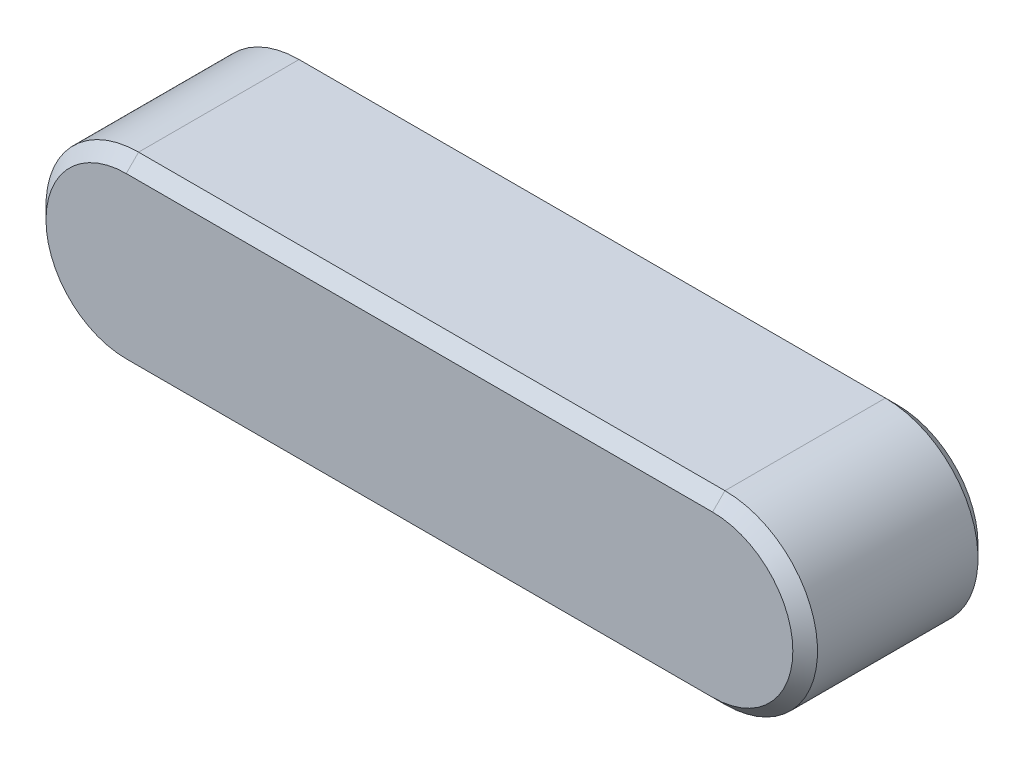
ISO-10303-21;
HEADER;
FILE_DESCRIPTION(('STEP AP214'),'2;1');
FILE_NAME('part.step','',(''),(''),'','','');
FILE_SCHEMA(('AUTOMOTIVE_DESIGN { 1 0 10303 214 1 1 1 1 }'));
ENDSEC;
DATA;
#1=APPLICATION_CONTEXT('core data for automotive mechanical design processes');
#2=APPLICATION_PROTOCOL_DEFINITION('international standard','automotive_design',2000,#1);
#3=PRODUCT_CONTEXT('',#1,'mechanical');
#4=PRODUCT('Part','Part','',(#3));
#5=PRODUCT_RELATED_PRODUCT_CATEGORY('part','',(#4));
#6=PRODUCT_DEFINITION_FORMATION('','',#4);
#7=PRODUCT_DEFINITION_CONTEXT('part definition',#1,'design');
#8=PRODUCT_DEFINITION('design','',#6,#7);
#9=PRODUCT_DEFINITION_SHAPE('','',#8);
#10=(LENGTH_UNIT() NAMED_UNIT(*) SI_UNIT(.MILLI.,.METRE.));
#11=(NAMED_UNIT(*) PLANE_ANGLE_UNIT() SI_UNIT($,.RADIAN.));
#12=(NAMED_UNIT(*) SI_UNIT($,.STERADIAN.) SOLID_ANGLE_UNIT());
#13=UNCERTAINTY_MEASURE_WITH_UNIT(LENGTH_MEASURE(1.E-05),#10,'distance_accuracy_value','');
#14=(GEOMETRIC_REPRESENTATION_CONTEXT(3) GLOBAL_UNCERTAINTY_ASSIGNED_CONTEXT((#13)) GLOBAL_UNIT_ASSIGNED_CONTEXT((#10,
#11,#12)) REPRESENTATION_CONTEXT('',''));
#15=CARTESIAN_POINT('',(0.,0.,0.));
#16=DIRECTION('',(0.,0.,1.));
#17=DIRECTION('',(1.,0.,0.));
#18=AXIS2_PLACEMENT_3D('',#15,#16,#17);
#19=CARTESIAN_POINT('',(-19.,0.,3.));
#20=DIRECTION('',(0.,0.,-1.));
#21=DIRECTION('',(-1.,0.,0.));
#22=AXIS2_PLACEMENT_3D('',#19,#20,#21);
#23=CYLINDRICAL_SURFACE('',#22,3.);
#24=DIRECTION('',(0.,0.,-1.));
#25=VECTOR('',#24,1.);
#26=CARTESIAN_POINT('',(-19.,-3.,3.));
#27=LINE('',#26,#25);
#28=CARTESIAN_POINT('',(-19.,-3.,2.6));
#29=VERTEX_POINT('',#28);
#30=CARTESIAN_POINT('',(-19.,-3.,-2.6));
#31=VERTEX_POINT('',#30);
#32=EDGE_CURVE('E122',#29,#31,#27,.T.);
#33=ORIENTED_EDGE('',*,*,#32,.F.);
#34=CARTESIAN_POINT('',(-19.,0.,2.6));
#35=DIRECTION('',(0.,0.,-1.));
#36=DIRECTION('',(-1.,0.,0.));
#37=AXIS2_PLACEMENT_3D('',#34,#35,#36);
#38=CIRCLE('',#37,3.);
#39=CARTESIAN_POINT('',(-19.,3.,2.6));
#40=VERTEX_POINT('',#39);
#41=EDGE_CURVE('E56',#29,#40,#38,.T.);
#42=ORIENTED_EDGE('',*,*,#41,.T.);
#43=DIRECTION('',(0.,0.,-1.));
#44=VECTOR('',#43,1.);
#45=CARTESIAN_POINT('',(-19.,3.,3.));
#46=LINE('',#45,#44);
#47=CARTESIAN_POINT('',(-19.,3.,-2.6));
#48=VERTEX_POINT('',#47);
#49=EDGE_CURVE('E160',#40,#48,#46,.T.);
#50=ORIENTED_EDGE('',*,*,#49,.T.);
#51=CARTESIAN_POINT('',(-19.,0.,-2.6));
#52=DIRECTION('',(0.,0.,-1.));
#53=DIRECTION('',(-1.,0.,0.));
#54=AXIS2_PLACEMENT_3D('',#51,#52,#53);
#55=CIRCLE('',#54,3.);
#56=EDGE_CURVE('E110',#48,#31,#55,.F.);
#57=ORIENTED_EDGE('',*,*,#56,.T.);
#58=EDGE_LOOP('',(#33,#42,#50,#57));
#59=FACE_BOUND('',#58,.T.);
#60=ADVANCED_FACE('F33',(#59),#23,.T.);
#61=CARTESIAN_POINT('',(0.,-3.,3.));
#62=DIRECTION('',(0.,1.,0.));
#63=DIRECTION('',(-1.,0.,0.));
#64=AXIS2_PLACEMENT_3D('',#61,#62,#63);
#65=PLANE('',#64);
#66=ORIENTED_EDGE('',*,*,#32,.T.);
#67=DIRECTION('',(1.,0.,0.));
#68=VECTOR('',#67,1.);
#69=CARTESIAN_POINT('',(0.,-3.,-2.6));
#70=LINE('',#69,#68);
#71=CARTESIAN_POINT('',(0.,-3.,-2.6));
#72=VERTEX_POINT('',#71);
#73=EDGE_CURVE('E121',#31,#72,#70,.T.);
#74=ORIENTED_EDGE('',*,*,#73,.T.);
#75=DIRECTION('',(0.,0.,-1.));
#76=VECTOR('',#75,1.);
#77=CARTESIAN_POINT('',(0.,-3.,3.));
#78=LINE('',#77,#76);
#79=CARTESIAN_POINT('',(0.,-3.,2.6));
#80=VERTEX_POINT('',#79);
#81=EDGE_CURVE('E104',#80,#72,#78,.T.);
#82=ORIENTED_EDGE('',*,*,#81,.F.);
#83=DIRECTION('',(-1.,0.,0.));
#84=VECTOR('',#83,1.);
#85=CARTESIAN_POINT('',(0.,-3.,2.6));
#86=LINE('',#85,#84);
#87=EDGE_CURVE('E119',#80,#29,#86,.T.);
#88=ORIENTED_EDGE('',*,*,#87,.T.);
#89=EDGE_LOOP('',(#66,#74,#82,#88));
#90=FACE_BOUND('',#89,.T.);
#91=ADVANCED_FACE('F118',(#90),#65,.F.);
#92=CARTESIAN_POINT('',(0.,0.,3.));
#93=DIRECTION('',(0.,0.,-1.));
#94=DIRECTION('',(-1.,0.,0.));
#95=AXIS2_PLACEMENT_3D('',#92,#93,#94);
#96=CYLINDRICAL_SURFACE('',#95,3.);
#97=DIRECTION('',(0.,0.,-1.));
#98=VECTOR('',#97,1.);
#99=CARTESIAN_POINT('',(0.,3.,3.));
#100=LINE('',#99,#98);
#101=CARTESIAN_POINT('',(0.,3.,2.6));
#102=VERTEX_POINT('',#101);
#103=CARTESIAN_POINT('',(0.,3.,-2.6));
#104=VERTEX_POINT('',#103);
#105=EDGE_CURVE('E105',#102,#104,#100,.T.);
#106=ORIENTED_EDGE('',*,*,#105,.F.);
#107=CARTESIAN_POINT('',(0.,0.,2.6));
#108=DIRECTION('',(0.,0.,-1.));
#109=DIRECTION('',(-1.,0.,0.));
#110=AXIS2_PLACEMENT_3D('',#107,#108,#109);
#111=CIRCLE('',#110,3.);
#112=EDGE_CURVE('E101',#102,#80,#111,.T.);
#113=ORIENTED_EDGE('',*,*,#112,.T.);
#114=ORIENTED_EDGE('',*,*,#81,.T.);
#115=CARTESIAN_POINT('',(0.,0.,-2.6));
#116=DIRECTION('',(0.,0.,-1.));
#117=DIRECTION('',(-1.,0.,0.));
#118=AXIS2_PLACEMENT_3D('',#115,#116,#117);
#119=CIRCLE('',#118,3.);
#120=EDGE_CURVE('E111',#72,#104,#119,.F.);
#121=ORIENTED_EDGE('',*,*,#120,.T.);
#122=EDGE_LOOP('',(#106,#113,#114,#121));
#123=FACE_BOUND('',#122,.T.);
#124=ADVANCED_FACE('F103',(#123),#96,.T.);
#125=CARTESIAN_POINT('',(-19.,3.,3.));
#126=DIRECTION('',(0.,-1.,0.));
#127=DIRECTION('',(0.,0.,-1.));
#128=AXIS2_PLACEMENT_3D('',#125,#126,#127);
#129=PLANE('',#128);
#130=ORIENTED_EDGE('',*,*,#49,.F.);
#131=DIRECTION('',(1.,0.,0.));
#132=VECTOR('',#131,1.);
#133=CARTESIAN_POINT('',(-19.,3.,2.6));
#134=LINE('',#133,#132);
#135=EDGE_CURVE('E11',#40,#102,#134,.T.);
#136=ORIENTED_EDGE('',*,*,#135,.T.);
#137=ORIENTED_EDGE('',*,*,#105,.T.);
#138=DIRECTION('',(-1.,0.,0.));
#139=VECTOR('',#138,1.);
#140=CARTESIAN_POINT('',(-19.,3.,-2.6));
#141=LINE('',#140,#139);
#142=EDGE_CURVE('E42',#104,#48,#141,.T.);
#143=ORIENTED_EDGE('',*,*,#142,.T.);
#144=EDGE_LOOP('',(#130,#136,#137,#143));
#145=FACE_BOUND('',#144,.T.);
#146=ADVANCED_FACE('F210',(#145),#129,.F.);
#147=CARTESIAN_POINT('',(-19.,0.,3.));
#148=DIRECTION('',(0.,0.,-1.));
#149=DIRECTION('',(-1.,0.,0.));
#150=AXIS2_PLACEMENT_3D('',#147,#148,#149);
#151=PLANE('',#150);
#152=CARTESIAN_POINT('',(-19.,0.,3.));
#153=DIRECTION('',(0.,0.,-1.));
#154=DIRECTION('',(-1.,0.,0.));
#155=AXIS2_PLACEMENT_3D('',#152,#153,#154);
#156=CIRCLE('',#155,2.6);
#157=CARTESIAN_POINT('',(-19.,2.6,3.));
#158=VERTEX_POINT('',#157);
#159=CARTESIAN_POINT('',(-19.,-2.6,3.));
#160=VERTEX_POINT('',#159);
#161=EDGE_CURVE('E181',#158,#160,#156,.F.);
#162=ORIENTED_EDGE('',*,*,#161,.T.);
#163=DIRECTION('',(1.,0.,0.));
#164=VECTOR('',#163,1.);
#165=CARTESIAN_POINT('',(-19.,-2.6,3.));
#166=LINE('',#165,#164);
#167=CARTESIAN_POINT('',(0.,-2.6,3.));
#168=VERTEX_POINT('',#167);
#169=EDGE_CURVE('E184',#160,#168,#166,.T.);
#170=ORIENTED_EDGE('',*,*,#169,.T.);
#171=CARTESIAN_POINT('',(0.,0.,3.));
#172=DIRECTION('',(0.,0.,-1.));
#173=DIRECTION('',(-1.,0.,0.));
#174=AXIS2_PLACEMENT_3D('',#171,#172,#173);
#175=CIRCLE('',#174,2.6);
#176=CARTESIAN_POINT('',(0.,2.6,3.));
#177=VERTEX_POINT('',#176);
#178=EDGE_CURVE('E133',#168,#177,#175,.F.);
#179=ORIENTED_EDGE('',*,*,#178,.T.);
#180=DIRECTION('',(-1.,0.,0.));
#181=VECTOR('',#180,1.);
#182=CARTESIAN_POINT('',(-19.,2.6,3.));
#183=LINE('',#182,#181);
#184=EDGE_CURVE('E179',#177,#158,#183,.T.);
#185=ORIENTED_EDGE('',*,*,#184,.T.);
#186=EDGE_LOOP('',(#162,#170,#179,#185));
#187=FACE_BOUND('',#186,.T.);
#188=ADVANCED_FACE('F213',(#187),#151,.F.);
#189=CARTESIAN_POINT('',(-19.,0.,-3.));
#190=DIRECTION('',(0.,0.,-1.));
#191=DIRECTION('',(-1.,0.,0.));
#192=AXIS2_PLACEMENT_3D('',#189,#190,#191);
#193=PLANE('',#192);
#194=CARTESIAN_POINT('',(0.,0.,-3.));
#195=DIRECTION('',(0.,0.,-1.));
#196=DIRECTION('',(-1.,0.,0.));
#197=AXIS2_PLACEMENT_3D('',#194,#195,#196);
#198=CIRCLE('',#197,2.6);
#199=CARTESIAN_POINT('',(0.,2.6,-3.));
#200=VERTEX_POINT('',#199);
#201=CARTESIAN_POINT('',(0.,-2.6,-3.));
#202=VERTEX_POINT('',#201);
#203=EDGE_CURVE('E174',#200,#202,#198,.T.);
#204=ORIENTED_EDGE('',*,*,#203,.T.);
#205=DIRECTION('',(-1.,0.,0.));
#206=VECTOR('',#205,1.);
#207=CARTESIAN_POINT('',(-19.,-2.6,-3.));
#208=LINE('',#207,#206);
#209=CARTESIAN_POINT('',(-19.,-2.6,-3.));
#210=VERTEX_POINT('',#209);
#211=EDGE_CURVE('E176',#202,#210,#208,.T.);
#212=ORIENTED_EDGE('',*,*,#211,.T.);
#213=CARTESIAN_POINT('',(-19.,0.,-3.));
#214=DIRECTION('',(0.,0.,-1.));
#215=DIRECTION('',(-1.,0.,0.));
#216=AXIS2_PLACEMENT_3D('',#213,#214,#215);
#217=CIRCLE('',#216,2.6);
#218=CARTESIAN_POINT('',(-19.,2.6,-3.));
#219=VERTEX_POINT('',#218);
#220=EDGE_CURVE('E172',#210,#219,#217,.T.);
#221=ORIENTED_EDGE('',*,*,#220,.T.);
#222=DIRECTION('',(1.,0.,0.));
#223=VECTOR('',#222,1.);
#224=CARTESIAN_POINT('',(0.,2.6,-3.));
#225=LINE('',#224,#223);
#226=EDGE_CURVE('E170',#219,#200,#225,.T.);
#227=ORIENTED_EDGE('',*,*,#226,.T.);
#228=EDGE_LOOP('',(#204,#212,#221,#227));
#229=FACE_BOUND('',#228,.T.);
#230=ADVANCED_FACE('F214',(#229),#193,.T.);
#231=CARTESIAN_POINT('',(-19.,3.,-2.6));
#232=DIRECTION('',(0.,0.707106781186547,-0.707106781186547));
#233=DIRECTION('',(0.,0.707106781186548,0.707106781186548));
#234=AXIS2_PLACEMENT_3D('',#231,#232,#233);
#235=PLANE('',#234);
#236=DIRECTION('',(0.,0.707106781186547,0.707106781186547));
#237=VECTOR('',#236,1.);
#238=CARTESIAN_POINT('',(0.,2.6,-3.));
#239=LINE('',#238,#237);
#240=EDGE_CURVE('E152',#200,#104,#239,.T.);
#241=ORIENTED_EDGE('',*,*,#240,.F.);
#242=ORIENTED_EDGE('',*,*,#226,.F.);
#243=DIRECTION('',(0.,-0.707106781186547,-0.707106781186547));
#244=VECTOR('',#243,1.);
#245=CARTESIAN_POINT('',(-19.,3.,-2.6));
#246=LINE('',#245,#244);
#247=EDGE_CURVE('E139',#48,#219,#246,.T.);
#248=ORIENTED_EDGE('',*,*,#247,.F.);
#249=ORIENTED_EDGE('',*,*,#142,.F.);
#250=EDGE_LOOP('',(#241,#242,#248,#249));
#251=FACE_BOUND('',#250,.T.);
#252=ADVANCED_FACE('F217',(#251),#235,.T.);
#253=CARTESIAN_POINT('',(-19.,0.,-2.6));
#254=DIRECTION('',(0.,0.,1.));
#255=DIRECTION('',(1.,0.,0.));
#256=AXIS2_PLACEMENT_3D('',#253,#254,#255);
#257=CONICAL_SURFACE('',#256,3.,0.785398163397448);
#258=ORIENTED_EDGE('',*,*,#247,.T.);
#259=ORIENTED_EDGE('',*,*,#220,.F.);
#260=DIRECTION('',(0.,0.707106781186547,-0.707106781186547));
#261=VECTOR('',#260,1.);
#262=CARTESIAN_POINT('',(-19.,-3.,-2.6));
#263=LINE('',#262,#261);
#264=EDGE_CURVE('E146',#31,#210,#263,.T.);
#265=ORIENTED_EDGE('',*,*,#264,.F.);
#266=ORIENTED_EDGE('',*,*,#56,.F.);
#267=EDGE_LOOP('',(#258,#259,#265,#266));
#268=FACE_BOUND('',#267,.T.);
#269=ADVANCED_FACE('F189',(#268),#257,.T.);
#270=CARTESIAN_POINT('',(0.,0.,-2.6));
#271=DIRECTION('',(0.,0.,1.));
#272=DIRECTION('',(1.,0.,0.));
#273=AXIS2_PLACEMENT_3D('',#270,#271,#272);
#274=CONICAL_SURFACE('',#273,3.,0.785398163397448);
#275=ORIENTED_EDGE('',*,*,#240,.T.);
#276=ORIENTED_EDGE('',*,*,#120,.F.);
#277=DIRECTION('',(0.,-0.707106781186547,0.707106781186547));
#278=VECTOR('',#277,1.);
#279=CARTESIAN_POINT('',(0.,-2.6,-3.));
#280=LINE('',#279,#278);
#281=EDGE_CURVE('E142',#202,#72,#280,.T.);
#282=ORIENTED_EDGE('',*,*,#281,.F.);
#283=ORIENTED_EDGE('',*,*,#203,.F.);
#284=EDGE_LOOP('',(#275,#276,#282,#283));
#285=FACE_BOUND('',#284,.T.);
#286=ADVANCED_FACE('F192',(#285),#274,.T.);
#287=CARTESIAN_POINT('',(0.,-3.,-2.6));
#288=DIRECTION('',(0.,-0.707106781186548,-0.707106781186548));
#289=DIRECTION('',(0.,0.707106781186548,-0.707106781186548));
#290=AXIS2_PLACEMENT_3D('',#287,#288,#289);
#291=PLANE('',#290);
#292=ORIENTED_EDGE('',*,*,#264,.T.);
#293=ORIENTED_EDGE('',*,*,#211,.F.);
#294=ORIENTED_EDGE('',*,*,#281,.T.);
#295=ORIENTED_EDGE('',*,*,#73,.F.);
#296=EDGE_LOOP('',(#292,#293,#294,#295));
#297=FACE_BOUND('',#296,.T.);
#298=ADVANCED_FACE('F190',(#297),#291,.T.);
#299=CARTESIAN_POINT('',(-19.,2.6,3.));
#300=DIRECTION('',(0.,-0.707106781186547,-0.707106781186547));
#301=DIRECTION('',(0.,0.707106781186548,-0.707106781186548));
#302=AXIS2_PLACEMENT_3D('',#299,#300,#301);
#303=PLANE('',#302);
#304=DIRECTION('',(0.,-0.707106781186547,0.707106781186547));
#305=VECTOR('',#304,1.);
#306=CARTESIAN_POINT('',(0.,3.,2.6));
#307=LINE('',#306,#305);
#308=EDGE_CURVE('E136',#102,#177,#307,.T.);
#309=ORIENTED_EDGE('',*,*,#308,.F.);
#310=ORIENTED_EDGE('',*,*,#135,.F.);
#311=DIRECTION('',(0.,0.707106781186547,-0.707106781186547));
#312=VECTOR('',#311,1.);
#313=CARTESIAN_POINT('',(-19.,2.6,3.));
#314=LINE('',#313,#312);
#315=EDGE_CURVE('E37',#158,#40,#314,.T.);
#316=ORIENTED_EDGE('',*,*,#315,.F.);
#317=ORIENTED_EDGE('',*,*,#184,.F.);
#318=EDGE_LOOP('',(#309,#310,#316,#317));
#319=FACE_BOUND('',#318,.T.);
#320=ADVANCED_FACE('F35',(#319),#303,.F.);
#321=CARTESIAN_POINT('',(-19.,0.,3.));
#322=DIRECTION('',(0.,0.,-1.));
#323=DIRECTION('',(-1.,0.,0.));
#324=AXIS2_PLACEMENT_3D('',#321,#322,#323);
#325=CONICAL_SURFACE('',#324,2.6,0.785398163397448);
#326=ORIENTED_EDGE('',*,*,#315,.T.);
#327=ORIENTED_EDGE('',*,*,#41,.F.);
#328=DIRECTION('',(0.,-0.707106781186547,-0.707106781186547));
#329=VECTOR('',#328,1.);
#330=CARTESIAN_POINT('',(-19.,-2.6,3.));
#331=LINE('',#330,#329);
#332=EDGE_CURVE('E130',#160,#29,#331,.T.);
#333=ORIENTED_EDGE('',*,*,#332,.F.);
#334=ORIENTED_EDGE('',*,*,#161,.F.);
#335=EDGE_LOOP('',(#326,#327,#333,#334));
#336=FACE_BOUND('',#335,.T.);
#337=ADVANCED_FACE('F198',(#336),#325,.T.);
#338=CARTESIAN_POINT('',(0.,0.,3.));
#339=DIRECTION('',(0.,0.,-1.));
#340=DIRECTION('',(-1.,0.,0.));
#341=AXIS2_PLACEMENT_3D('',#338,#339,#340);
#342=CONICAL_SURFACE('',#341,2.6,0.785398163397448);
#343=ORIENTED_EDGE('',*,*,#308,.T.);
#344=ORIENTED_EDGE('',*,*,#178,.F.);
#345=DIRECTION('',(0.,0.707106781186547,0.707106781186547));
#346=VECTOR('',#345,1.);
#347=CARTESIAN_POINT('',(0.,-3.,2.6));
#348=LINE('',#347,#346);
#349=EDGE_CURVE('E127',#80,#168,#348,.T.);
#350=ORIENTED_EDGE('',*,*,#349,.F.);
#351=ORIENTED_EDGE('',*,*,#112,.F.);
#352=EDGE_LOOP('',(#343,#344,#350,#351));
#353=FACE_BOUND('',#352,.T.);
#354=ADVANCED_FACE('F132',(#353),#342,.T.);
#355=CARTESIAN_POINT('',(-19.,-2.6,3.));
#356=DIRECTION('',(0.,0.707106781186547,-0.707106781186547));
#357=DIRECTION('',(0.,0.707106781186548,0.707106781186548));
#358=AXIS2_PLACEMENT_3D('',#355,#356,#357);
#359=PLANE('',#358);
#360=ORIENTED_EDGE('',*,*,#332,.T.);
#361=ORIENTED_EDGE('',*,*,#87,.F.);
#362=ORIENTED_EDGE('',*,*,#349,.T.);
#363=ORIENTED_EDGE('',*,*,#169,.F.);
#364=EDGE_LOOP('',(#360,#361,#362,#363));
#365=FACE_BOUND('',#364,.T.);
#366=ADVANCED_FACE('F125',(#365),#359,.F.);
#367=CLOSED_SHELL('',(#60,#91,#124,#146,#188,#230,#252,#269,#286,#298,#320,#337,#354,#366));
#368=MANIFOLD_SOLID_BREP('B2',#367);
#369=ADVANCED_BREP_SHAPE_REPRESENTATION('',(#18,#368),#14);
#370=SHAPE_DEFINITION_REPRESENTATION(#9,#369);
ENDSEC;
END-ISO-10303-21;
